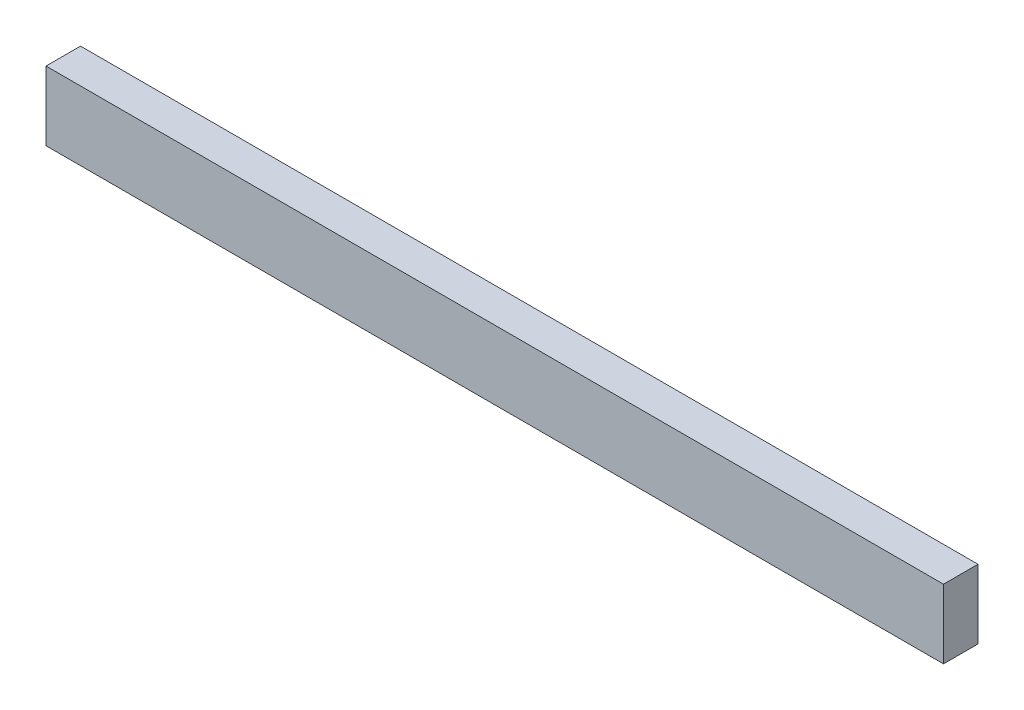
ISO-10303-21;
HEADER;
FILE_DESCRIPTION(('STEP AP214'),'2;1');
FILE_NAME('part.step','',(''),(''),'','','');
FILE_SCHEMA(('AUTOMOTIVE_DESIGN { 1 0 10303 214 1 1 1 1 }'));
ENDSEC;
DATA;
#1=APPLICATION_CONTEXT('core data for automotive mechanical design processes');
#2=APPLICATION_PROTOCOL_DEFINITION('international standard','automotive_design',2000,#1);
#3=PRODUCT_CONTEXT('',#1,'mechanical');
#4=PRODUCT('Part','Part','',(#3));
#5=PRODUCT_RELATED_PRODUCT_CATEGORY('part','',(#4));
#6=PRODUCT_DEFINITION_FORMATION('','',#4);
#7=PRODUCT_DEFINITION_CONTEXT('part definition',#1,'design');
#8=PRODUCT_DEFINITION('design','',#6,#7);
#9=PRODUCT_DEFINITION_SHAPE('','',#8);
#10=(LENGTH_UNIT() NAMED_UNIT(*) SI_UNIT(.MILLI.,.METRE.));
#11=(NAMED_UNIT(*) PLANE_ANGLE_UNIT() SI_UNIT($,.RADIAN.));
#12=(NAMED_UNIT(*) SI_UNIT($,.STERADIAN.) SOLID_ANGLE_UNIT());
#13=UNCERTAINTY_MEASURE_WITH_UNIT(LENGTH_MEASURE(1.E-05),#10,'distance_accuracy_value','');
#14=(GEOMETRIC_REPRESENTATION_CONTEXT(3) GLOBAL_UNCERTAINTY_ASSIGNED_CONTEXT((#13)) GLOBAL_UNIT_ASSIGNED_CONTEXT((#10,
#11,#12)) REPRESENTATION_CONTEXT('',''));
#15=CARTESIAN_POINT('',(0.,0.,0.));
#16=DIRECTION('',(0.,0.,1.));
#17=DIRECTION('',(1.,0.,0.));
#18=AXIS2_PLACEMENT_3D('',#15,#16,#17);
#19=CARTESIAN_POINT('',(-139.035099734613,20.,32.9912280701755));
#20=DIRECTION('',(1.,0.,0.));
#21=DIRECTION('',(0.,0.,-1.));
#22=AXIS2_PLACEMENT_3D('',#19,#20,#21);
#23=PLANE('',#22);
#24=DIRECTION('',(0.,0.,1.));
#25=VECTOR('',#24,1.);
#26=CARTESIAN_POINT('',(-139.035099734613,0.,32.9912280701755));
#27=LINE('',#26,#25);
#28=CARTESIAN_POINT('',(-139.035099734613,0.,32.9912280701755));
#29=VERTEX_POINT('',#28);
#30=CARTESIAN_POINT('',(-139.035099734613,0.,42.9912280701755));
#31=VERTEX_POINT('',#30);
#32=EDGE_CURVE('E113',#29,#31,#27,.T.);
#33=ORIENTED_EDGE('',*,*,#32,.T.);
#34=DIRECTION('',(0.,-1.,0.));
#35=VECTOR('',#34,1.);
#36=CARTESIAN_POINT('',(-139.035099734613,20.,42.9912280701755));
#37=LINE('',#36,#35);
#38=CARTESIAN_POINT('',(-139.035099734613,20.,42.9912280701755));
#39=VERTEX_POINT('',#38);
#40=EDGE_CURVE('E11',#39,#31,#37,.T.);
#41=ORIENTED_EDGE('',*,*,#40,.F.);
#42=DIRECTION('',(0.,0.,1.));
#43=VECTOR('',#42,1.);
#44=CARTESIAN_POINT('',(-139.035099734613,20.,32.9912280701755));
#45=LINE('',#44,#43);
#46=CARTESIAN_POINT('',(-139.035099734613,20.,32.9912280701755));
#47=VERTEX_POINT('',#46);
#48=EDGE_CURVE('E97',#47,#39,#45,.T.);
#49=ORIENTED_EDGE('',*,*,#48,.F.);
#50=DIRECTION('',(0.,-1.,0.));
#51=VECTOR('',#50,1.);
#52=CARTESIAN_POINT('',(-139.035099734613,20.,32.9912280701755));
#53=LINE('',#52,#51);
#54=EDGE_CURVE('E109',#47,#29,#53,.T.);
#55=ORIENTED_EDGE('',*,*,#54,.T.);
#56=EDGE_LOOP('',(#33,#41,#49,#55));
#57=FACE_BOUND('',#56,.T.);
#58=ADVANCED_FACE('F45',(#57),#23,.F.);
#59=CARTESIAN_POINT('',(-139.035099734613,20.,42.9912280701755));
#60=DIRECTION('',(0.,0.,-1.));
#61=DIRECTION('',(-1.,0.,0.));
#62=AXIS2_PLACEMENT_3D('',#59,#60,#61);
#63=PLANE('',#62);
#64=DIRECTION('',(1.,0.,0.));
#65=VECTOR('',#64,1.);
#66=CARTESIAN_POINT('',(-139.035099734613,0.,42.9912280701755));
#67=LINE('',#66,#65);
#68=CARTESIAN_POINT('',(120.964900265387,0.,42.9912280701755));
#69=VERTEX_POINT('',#68);
#70=EDGE_CURVE('E102',#31,#69,#67,.T.);
#71=ORIENTED_EDGE('',*,*,#70,.T.);
#72=DIRECTION('',(0.,-1.,0.));
#73=VECTOR('',#72,1.);
#74=CARTESIAN_POINT('',(120.964900265387,20.,42.9912280701755));
#75=LINE('',#74,#73);
#76=CARTESIAN_POINT('',(120.964900265387,20.,42.9912280701755));
#77=VERTEX_POINT('',#76);
#78=EDGE_CURVE('E54',#77,#69,#75,.T.);
#79=ORIENTED_EDGE('',*,*,#78,.F.);
#80=DIRECTION('',(1.,0.,0.));
#81=VECTOR('',#80,1.);
#82=CARTESIAN_POINT('',(-139.035099734613,20.,42.9912280701755));
#83=LINE('',#82,#81);
#84=EDGE_CURVE('E92',#39,#77,#83,.T.);
#85=ORIENTED_EDGE('',*,*,#84,.F.);
#86=ORIENTED_EDGE('',*,*,#40,.T.);
#87=EDGE_LOOP('',(#71,#79,#85,#86));
#88=FACE_BOUND('',#87,.T.);
#89=ADVANCED_FACE('F101',(#88),#63,.F.);
#90=CARTESIAN_POINT('',(120.964900265387,20.,32.9912280701755));
#91=DIRECTION('',(-1.,0.,0.));
#92=DIRECTION('',(0.,0.,1.));
#93=AXIS2_PLACEMENT_3D('',#90,#91,#92);
#94=PLANE('',#93);
#95=DIRECTION('',(0.,0.,-1.));
#96=VECTOR('',#95,1.);
#97=CARTESIAN_POINT('',(120.964900265387,0.,32.9912280701755));
#98=LINE('',#97,#96);
#99=CARTESIAN_POINT('',(120.964900265387,0.,32.9912280701755));
#100=VERTEX_POINT('',#99);
#101=EDGE_CURVE('E79',#69,#100,#98,.T.);
#102=ORIENTED_EDGE('',*,*,#101,.T.);
#103=DIRECTION('',(0.,-1.,0.));
#104=VECTOR('',#103,1.);
#105=CARTESIAN_POINT('',(120.964900265387,20.,32.9912280701755));
#106=LINE('',#105,#104);
#107=CARTESIAN_POINT('',(120.964900265387,20.,32.9912280701755));
#108=VERTEX_POINT('',#107);
#109=EDGE_CURVE('E104',#108,#100,#106,.T.);
#110=ORIENTED_EDGE('',*,*,#109,.F.);
#111=DIRECTION('',(0.,0.,-1.));
#112=VECTOR('',#111,1.);
#113=CARTESIAN_POINT('',(120.964900265387,20.,32.9912280701755));
#114=LINE('',#113,#112);
#115=EDGE_CURVE('E95',#77,#108,#114,.T.);
#116=ORIENTED_EDGE('',*,*,#115,.F.);
#117=ORIENTED_EDGE('',*,*,#78,.T.);
#118=EDGE_LOOP('',(#102,#110,#116,#117));
#119=FACE_BOUND('',#118,.T.);
#120=ADVANCED_FACE('F105',(#119),#94,.F.);
#121=CARTESIAN_POINT('',(-139.035099734613,20.,32.9912280701755));
#122=DIRECTION('',(0.,0.,1.));
#123=DIRECTION('',(1.,0.,0.));
#124=AXIS2_PLACEMENT_3D('',#121,#122,#123);
#125=PLANE('',#124);
#126=DIRECTION('',(-1.,0.,0.));
#127=VECTOR('',#126,1.);
#128=CARTESIAN_POINT('',(-139.035099734613,0.,32.9912280701755));
#129=LINE('',#128,#127);
#130=EDGE_CURVE('E85',#100,#29,#129,.T.);
#131=ORIENTED_EDGE('',*,*,#130,.T.);
#132=ORIENTED_EDGE('',*,*,#54,.F.);
#133=DIRECTION('',(-1.,0.,0.));
#134=VECTOR('',#133,1.);
#135=CARTESIAN_POINT('',(-139.035099734613,20.,32.9912280701755));
#136=LINE('',#135,#134);
#137=EDGE_CURVE('E62',#108,#47,#136,.T.);
#138=ORIENTED_EDGE('',*,*,#137,.F.);
#139=ORIENTED_EDGE('',*,*,#109,.T.);
#140=EDGE_LOOP('',(#131,#132,#138,#139));
#141=FACE_BOUND('',#140,.T.);
#142=ADVANCED_FACE('F126',(#141),#125,.F.);
#143=CARTESIAN_POINT('',(0.,20.,0.));
#144=DIRECTION('',(0.,1.,0.));
#145=DIRECTION('',(0.,0.,1.));
#146=AXIS2_PLACEMENT_3D('',#143,#144,#145);
#147=PLANE('',#146);
#148=ORIENTED_EDGE('',*,*,#48,.T.);
#149=ORIENTED_EDGE('',*,*,#84,.T.);
#150=ORIENTED_EDGE('',*,*,#115,.T.);
#151=ORIENTED_EDGE('',*,*,#137,.T.);
#152=EDGE_LOOP('',(#148,#149,#150,#151));
#153=FACE_BOUND('',#152,.T.);
#154=ADVANCED_FACE('F93',(#153),#147,.T.);
#155=CARTESIAN_POINT('',(0.,0.,0.));
#156=DIRECTION('',(0.,1.,0.));
#157=DIRECTION('',(0.,0.,1.));
#158=AXIS2_PLACEMENT_3D('',#155,#156,#157);
#159=PLANE('',#158);
#160=ORIENTED_EDGE('',*,*,#32,.F.);
#161=ORIENTED_EDGE('',*,*,#130,.F.);
#162=ORIENTED_EDGE('',*,*,#101,.F.);
#163=ORIENTED_EDGE('',*,*,#70,.F.);
#164=EDGE_LOOP('',(#160,#161,#162,#163));
#165=FACE_BOUND('',#164,.T.);
#166=ADVANCED_FACE('F129',(#165),#159,.F.);
#167=CLOSED_SHELL('',(#58,#89,#120,#142,#154,#166));
#168=MANIFOLD_SOLID_BREP('B2',#167);
#169=ADVANCED_BREP_SHAPE_REPRESENTATION('',(#18,#168),#14);
#170=SHAPE_DEFINITION_REPRESENTATION(#9,#169);
ENDSEC;
END-ISO-10303-21;
